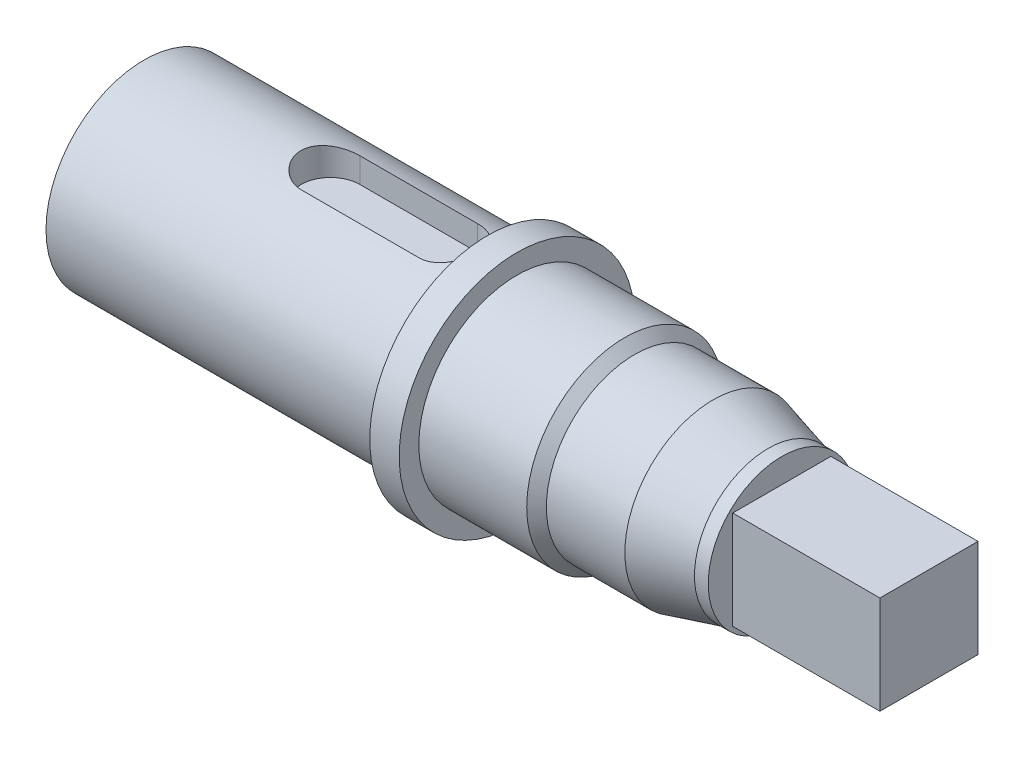
ISO-10303-21;
HEADER;
FILE_DESCRIPTION(('STEP AP214'),'2;1');
FILE_NAME('part.step','',(''),(''),'','','');
FILE_SCHEMA(('AUTOMOTIVE_DESIGN { 1 0 10303 214 1 1 1 1 }'));
ENDSEC;
DATA;
#1=APPLICATION_CONTEXT('core data for automotive mechanical design processes');
#2=APPLICATION_PROTOCOL_DEFINITION('international standard','automotive_design',2000,#1);
#3=PRODUCT_CONTEXT('',#1,'mechanical');
#4=PRODUCT('Part','Part','',(#3));
#5=PRODUCT_RELATED_PRODUCT_CATEGORY('part','',(#4));
#6=PRODUCT_DEFINITION_FORMATION('','',#4);
#7=PRODUCT_DEFINITION_CONTEXT('part definition',#1,'design');
#8=PRODUCT_DEFINITION('design','',#6,#7);
#9=PRODUCT_DEFINITION_SHAPE('','',#8);
#10=(LENGTH_UNIT() NAMED_UNIT(*) SI_UNIT(.MILLI.,.METRE.));
#11=(NAMED_UNIT(*) PLANE_ANGLE_UNIT() SI_UNIT($,.RADIAN.));
#12=(NAMED_UNIT(*) SI_UNIT($,.STERADIAN.) SOLID_ANGLE_UNIT());
#13=UNCERTAINTY_MEASURE_WITH_UNIT(LENGTH_MEASURE(1.E-05),#10,'distance_accuracy_value','');
#14=(GEOMETRIC_REPRESENTATION_CONTEXT(3) GLOBAL_UNCERTAINTY_ASSIGNED_CONTEXT((#13)) GLOBAL_UNIT_ASSIGNED_CONTEXT((#10,
#11,#12)) REPRESENTATION_CONTEXT('',''));
#15=CARTESIAN_POINT('',(0.,0.,0.));
#16=DIRECTION('',(0.,0.,1.));
#17=DIRECTION('',(1.,0.,0.));
#18=AXIS2_PLACEMENT_3D('',#15,#16,#17);
#19=CARTESIAN_POINT('',(0.,0.,0.));
#20=DIRECTION('',(1.,0.,0.));
#21=DIRECTION('',(0.,0.,-1.));
#22=AXIS2_PLACEMENT_3D('',#19,#20,#21);
#23=CYLINDRICAL_SURFACE('',#22,10.);
#24=CARTESIAN_POINT('',(-25.,0.,0.));
#25=DIRECTION('',(1.,0.,0.));
#26=DIRECTION('',(0.,0.,-1.));
#27=AXIS2_PLACEMENT_3D('',#24,#25,#26);
#28=CIRCLE('',#27,10.);
#29=CARTESIAN_POINT('',(-25.,0.,-10.));
#30=VERTEX_POINT('',#29);
#31=EDGE_CURVE('E170',#30,#30,#28,.T.);
#32=ORIENTED_EDGE('',*,*,#31,.T.);
#33=EDGE_LOOP('',(#32));
#34=FACE_BOUND('',#33,.T.);
#35=CARTESIAN_POINT('',(10.,0.,0.));
#36=DIRECTION('',(1.,0.,0.));
#37=DIRECTION('',(0.,0.,-1.));
#38=AXIS2_PLACEMENT_3D('',#35,#36,#37);
#39=CIRCLE('',#38,10.);
#40=CARTESIAN_POINT('',(10.,0.,-10.));
#41=VERTEX_POINT('',#40);
#42=EDGE_CURVE('E173',#41,#41,#39,.T.);
#43=ORIENTED_EDGE('',*,*,#42,.F.);
#44=EDGE_LOOP('',(#43));
#45=FACE_BOUND('',#44,.T.);
#46=DIRECTION('',(1.,0.,0.));
#47=VECTOR('',#46,1.);
#48=CARTESIAN_POINT('',(0.,9.53939201416945,3.));
#49=LINE('',#48,#47);
#50=CARTESIAN_POINT('',(6.,9.53939201416945,3.));
#51=VERTEX_POINT('',#50);
#52=CARTESIAN_POINT('',(-6.,9.53939201416945,3.));
#53=VERTEX_POINT('',#52);
#54=EDGE_CURVE('E51',#51,#53,#49,.F.);
#55=ORIENTED_EDGE('',*,*,#54,.T.);
#56=CARTESIAN_POINT('',(-6.,9.53939201416945,3.));
#57=CARTESIAN_POINT('',(-6.08233552082269,9.53938054248206,3.00001027845728));
#58=CARTESIAN_POINT('',(-6.16466445506322,9.54045772064378,2.99661062684472));
#59=CARTESIAN_POINT('',(-6.32869395276546,9.54470412105986,2.98307142899347));
#60=CARTESIAN_POINT('',(-6.41039465332436,9.54787287296848,2.97293339805418));
#61=CARTESIAN_POINT('',(-6.57238491567318,9.55620668351003,2.94603140625045));
#62=CARTESIAN_POINT('',(-6.65267752404303,9.56136667250114,2.92928426957737));
#63=CARTESIAN_POINT('',(-6.81147584413423,9.57351626651178,2.88932853030395));
#64=CARTESIAN_POINT('',(-6.8899815090674,9.58050591937827,2.86611975872641));
#65=CARTESIAN_POINT('',(-7.12194938799015,9.60391637654136,2.78708584446024));
#66=CARTESIAN_POINT('',(-7.27206843883301,9.6227900783039,2.72181852542972));
#67=CARTESIAN_POINT('',(-7.55922604397904,9.66493213967819,2.56815043531276));
#68=CARTESIAN_POINT('',(-7.69625847076217,9.6882025429064,2.4797388992416));
#69=CARTESIAN_POINT('',(-7.95772298794783,9.73733650515374,2.27929879634442));
#70=CARTESIAN_POINT('',(-8.08168487406091,9.76325505469874,2.16666914746584));
#71=CARTESIAN_POINT('',(-8.30927361483876,9.81429628475077,1.92227736150433));
#72=CARTESIAN_POINT('',(-8.41289703386101,9.8394188301941,1.79051199848164));
#73=CARTESIAN_POINT('',(-8.59892686509456,9.88666477976534,1.50821997465697));
#74=CARTESIAN_POINT('',(-8.68085017978262,9.90871541546877,1.35736167401016));
#75=CARTESIAN_POINT('',(-8.81797700400293,9.94668940088144,1.04324233568303));
#76=CARTESIAN_POINT('',(-8.87318740336795,9.96261433032402,0.879984508687983));
#77=CARTESIAN_POINT('',(-8.953759551791,9.98615279768397,0.550649404820599));
#78=CARTESIAN_POINT('',(-8.97992970351762,9.99399098526792,0.3847862530162));
#79=CARTESIAN_POINT('',(-9.00423469514604,10.0012640407204,0.0508471415689248));
#80=CARTESIAN_POINT('',(-9.00237484267818,10.0007004995012,-0.117228393125342));
#81=CARTESIAN_POINT('',(-8.97121417930856,9.99139205125586,-0.445143199271827));
#82=CARTESIAN_POINT('',(-8.94278930919189,9.98290831016512,-0.60507429076303));
#83=CARTESIAN_POINT('',(-8.86073673037451,9.95903027401822,-0.917780104370316));
#84=CARTESIAN_POINT('',(-8.80710770131732,9.94363561692558,-1.07055445110879));
#85=CARTESIAN_POINT('',(-8.67557555647525,9.90730429851782,-1.36669563173912));
#86=CARTESIAN_POINT('',(-8.5973967112239,9.88630511384914,-1.50993201207613));
#87=CARTESIAN_POINT('',(-8.41920281996559,9.84099249303646,-1.78153105916101));
#88=CARTESIAN_POINT('',(-8.3191828810593,9.81667831471806,-1.90989038323251));
#89=CARTESIAN_POINT('',(-8.09561602381536,9.7662334714278,-2.15330901082206));
#90=CARTESIAN_POINT('',(-7.97131227247379,9.74006890899097,-2.26766702955976));
#91=CARTESIAN_POINT('',(-7.70500515314889,9.68968430229327,-2.47413538985067));
#92=CARTESIAN_POINT('',(-7.56299663927022,9.66546482675133,-2.5662392402618));
#93=CARTESIAN_POINT('',(-7.26343814310014,9.62154457591303,-2.72632814481701));
#94=CARTESIAN_POINT('',(-7.10574564081286,9.60189192491895,-2.79406012682263));
#95=CARTESIAN_POINT('',(-6.78055099203685,9.56991327306402,-2.90171772009404));
#96=CARTESIAN_POINT('',(-6.61306427857131,9.55757606951749,-2.94168586436072));
#97=CARTESIAN_POINT('',(-6.3700102218596,9.54628064650011,-2.97802407180159));
#98=CARTESIAN_POINT('',(-6.29621853164078,9.54370312550533,-2.98626405978017));
#99=CARTESIAN_POINT('',(-6.14829704180096,9.54025857223564,-2.99724711229708));
#100=CARTESIAN_POINT('',(-6.07416790067231,9.53938902493287,-2.99999825936538));
#101=CARTESIAN_POINT('',(-6.,9.53939201416945,-3.));
#102=B_SPLINE_CURVE_WITH_KNOTS('',3,(#56,#57,#58,#59,#60,#61,#62,#63,#64,#65,#66,#67,#68,#69,
#70,#71,#72,#73,#74,#75,#76,#77,#78,#79,#80,#81,#82,#83,#84,#85,#86,#87,#88,#89,#90,#91,#92,#93,
#94,#95,#96,#97,#98,#99,#100,#101),.UNSPECIFIED.,.F.,.F.,(4,2,2,2,2,2,2,2,2,2,2,2,2,2,2,2,2,2,2,
2,2,2,4),(0.,0.246918142439468,0.493780777706085,0.740019009623012,0.986263681482026,
1.47813347402025,1.97023245590779,2.47635119822766,2.98255536239033,3.4992281062007,
4.01576751791672,4.51753600864764,5.01920948804101,5.50490358251093,5.99062312360832,
6.48200583350621,6.9734987373917,7.48389234847122,7.99443465298715,8.51013494368214,
9.02504345105574,9.24774267716777,9.47011372732391),.UNSPECIFIED.);
#103=CARTESIAN_POINT('',(-6.,9.53939201416945,-3.));
#104=VERTEX_POINT('',#103);
#105=EDGE_CURVE('E12',#53,#104,#102,.T.);
#106=ORIENTED_EDGE('',*,*,#105,.T.);
#107=DIRECTION('',(1.,0.,0.));
#108=VECTOR('',#107,1.);
#109=CARTESIAN_POINT('',(0.,9.53939201416945,-3.));
#110=LINE('',#109,#108);
#111=CARTESIAN_POINT('',(6.,9.53939201416945,-3.));
#112=VERTEX_POINT('',#111);
#113=EDGE_CURVE('E197',#104,#112,#110,.T.);
#114=ORIENTED_EDGE('',*,*,#113,.T.);
#115=CARTESIAN_POINT('',(6.,9.53939201416945,-3.));
#116=CARTESIAN_POINT('',(6.08233552082269,9.53938054248206,-3.00001027845728));
#117=CARTESIAN_POINT('',(6.16466445506322,9.54045772064378,-2.99661062684472));
#118=CARTESIAN_POINT('',(6.32869395276546,9.54470412105986,-2.98307142899347));
#119=CARTESIAN_POINT('',(6.41039465332436,9.54787287296848,-2.97293339805418));
#120=CARTESIAN_POINT('',(6.57238491567318,9.55620668351003,-2.94603140625045));
#121=CARTESIAN_POINT('',(6.65267752404303,9.56136667250114,-2.92928426957737));
#122=CARTESIAN_POINT('',(6.81147584413423,9.57351626651178,-2.88932853030395));
#123=CARTESIAN_POINT('',(6.8899815090674,9.58050591937827,-2.86611975872641));
#124=CARTESIAN_POINT('',(7.12194938799015,9.60391637654136,-2.78708584446024));
#125=CARTESIAN_POINT('',(7.27206843883301,9.6227900783039,-2.72181852542972));
#126=CARTESIAN_POINT('',(7.55922604397904,9.66493213967819,-2.56815043531276));
#127=CARTESIAN_POINT('',(7.69625847076217,9.6882025429064,-2.4797388992416));
#128=CARTESIAN_POINT('',(7.95772298794783,9.73733650515374,-2.27929879634442));
#129=CARTESIAN_POINT('',(8.08168487406091,9.76325505469874,-2.16666914746584));
#130=CARTESIAN_POINT('',(8.30927361483876,9.81429628475077,-1.92227736150433));
#131=CARTESIAN_POINT('',(8.41289703386101,9.8394188301941,-1.79051199848164));
#132=CARTESIAN_POINT('',(8.59892686509456,9.88666477976534,-1.50821997465697));
#133=CARTESIAN_POINT('',(8.68085017978262,9.90871541546877,-1.35736167401016));
#134=CARTESIAN_POINT('',(8.81797700400293,9.94668940088144,-1.04324233568303));
#135=CARTESIAN_POINT('',(8.87318740336795,9.96261433032402,-0.879984508687983));
#136=CARTESIAN_POINT('',(8.953759551791,9.98615279768397,-0.550649404820599));
#137=CARTESIAN_POINT('',(8.97992970351762,9.99399098526792,-0.3847862530162));
#138=CARTESIAN_POINT('',(9.00423469514604,10.0012640407204,-0.0508471415689248));
#139=CARTESIAN_POINT('',(9.00237484267818,10.0007004995012,0.117228393125342));
#140=CARTESIAN_POINT('',(8.97121417930856,9.99139205125586,0.445143199271827));
#141=CARTESIAN_POINT('',(8.94278930919189,9.98290831016512,0.60507429076303));
#142=CARTESIAN_POINT('',(8.86073673037451,9.95903027401822,0.917780104370316));
#143=CARTESIAN_POINT('',(8.80710770131732,9.94363561692558,1.07055445110879));
#144=CARTESIAN_POINT('',(8.67557555647525,9.90730429851782,1.36669563173912));
#145=CARTESIAN_POINT('',(8.5973967112239,9.88630511384914,1.50993201207613));
#146=CARTESIAN_POINT('',(8.41920281996559,9.84099249303646,1.78153105916101));
#147=CARTESIAN_POINT('',(8.3191828810593,9.81667831471806,1.90989038323251));
#148=CARTESIAN_POINT('',(8.09561602381536,9.7662334714278,2.15330901082206));
#149=CARTESIAN_POINT('',(7.97131227247379,9.74006890899097,2.26766702955976));
#150=CARTESIAN_POINT('',(7.70500515314889,9.68968430229327,2.47413538985067));
#151=CARTESIAN_POINT('',(7.56299663927022,9.66546482675133,2.5662392402618));
#152=CARTESIAN_POINT('',(7.26343814310014,9.62154457591303,2.72632814481701));
#153=CARTESIAN_POINT('',(7.10574564081286,9.60189192491895,2.79406012682263));
#154=CARTESIAN_POINT('',(6.78055099203685,9.56991327306402,2.90171772009404));
#155=CARTESIAN_POINT('',(6.61306427857131,9.55757606951749,2.94168586436072));
#156=CARTESIAN_POINT('',(6.3700102218596,9.54628064650011,2.97802407180159));
#157=CARTESIAN_POINT('',(6.29621853164078,9.54370312550533,2.98626405978017));
#158=CARTESIAN_POINT('',(6.14829704180096,9.54025857223564,2.99724711229708));
#159=CARTESIAN_POINT('',(6.07416790067231,9.53938902493287,2.99999825936538));
#160=CARTESIAN_POINT('',(6.,9.53939201416945,3.));
#161=B_SPLINE_CURVE_WITH_KNOTS('',3,(#115,#116,#117,#118,#119,#120,#121,#122,#123,#124,#125,
#126,#127,#128,#129,#130,#131,#132,#133,#134,#135,#136,#137,#138,#139,#140,#141,#142,#143,#144,
#145,#146,#147,#148,#149,#150,#151,#152,#153,#154,#155,#156,#157,#158,#159,#160),.UNSPECIFIED.,
.F.,.F.,(4,2,2,2,2,2,2,2,2,2,2,2,2,2,2,2,2,2,2,2,2,2,4),(0.,0.246918142439468,0.493780777706085,
0.740019009623012,0.986263681482026,1.47813347402025,1.97023245590779,2.47635119822766,
2.98255536239033,3.4992281062007,4.01576751791672,4.51753600864764,5.01920948804101,
5.50490358251093,5.99062312360832,6.48200583350621,6.9734987373917,7.48389234847122,
7.99443465298715,8.51013494368214,9.02504345105574,9.24774267716777,9.47011372732391),.UNSPECIFIED.);
#162=EDGE_CURVE('E202',#112,#51,#161,.T.);
#163=ORIENTED_EDGE('',*,*,#162,.T.);
#164=EDGE_LOOP('',(#55,#106,#114,#163));
#165=FACE_BOUND('',#164,.T.);
#166=ADVANCED_FACE('F37',(#34,#45,#165),#23,.T.);
#167=CARTESIAN_POINT('',(0.,0.,0.));
#168=DIRECTION('',(1.,0.,0.));
#169=DIRECTION('',(0.,0.,-1.));
#170=AXIS2_PLACEMENT_3D('',#167,#168,#169);
#171=CYLINDRICAL_SURFACE('',#170,7.50000000000001);
#172=CARTESIAN_POINT('',(38.5980762113533,0.,0.));
#173=DIRECTION('',(1.,0.,0.));
#174=DIRECTION('',(0.,0.,-1.));
#175=AXIS2_PLACEMENT_3D('',#172,#173,#174);
#176=CIRCLE('',#175,7.50000000000001);
#177=CARTESIAN_POINT('',(38.5980762113533,0.,-7.50000000000001));
#178=VERTEX_POINT('',#177);
#179=EDGE_CURVE('E194',#178,#178,#176,.T.);
#180=ORIENTED_EDGE('',*,*,#179,.T.);
#181=EDGE_LOOP('',(#180));
#182=FACE_BOUND('',#181,.T.);
#183=CARTESIAN_POINT('',(40.,0.,0.));
#184=DIRECTION('',(1.,0.,0.));
#185=DIRECTION('',(0.,0.,-1.));
#186=AXIS2_PLACEMENT_3D('',#183,#184,#185);
#187=CIRCLE('',#186,7.50000000000001);
#188=CARTESIAN_POINT('',(40.,0.,-7.50000000000001));
#189=VERTEX_POINT('',#188);
#190=EDGE_CURVE('E164',#189,#189,#187,.F.);
#191=ORIENTED_EDGE('',*,*,#190,.T.);
#192=EDGE_LOOP('',(#191));
#193=FACE_BOUND('',#192,.T.);
#194=ADVANCED_FACE('F251',(#182,#193),#171,.T.);
#195=CARTESIAN_POINT('',(-25.,10.,0.));
#196=DIRECTION('',(-1.,0.,0.));
#197=DIRECTION('',(0.,0.,1.));
#198=AXIS2_PLACEMENT_3D('',#195,#196,#197);
#199=PLANE('',#198);
#200=ORIENTED_EDGE('',*,*,#31,.F.);
#201=EDGE_LOOP('',(#200));
#202=FACE_BOUND('',#201,.T.);
#203=ADVANCED_FACE('F39',(#202),#199,.T.);
#204=CARTESIAN_POINT('',(38.5980762113533,0.,0.));
#205=DIRECTION('',(-1.,0.,0.));
#206=DIRECTION('',(0.,0.,1.));
#207=AXIS2_PLACEMENT_3D('',#204,#205,#206);
#208=CONICAL_SURFACE('',#207,7.50000000000001,0.26179938779915);
#209=CARTESIAN_POINT('',(33.,0.,0.));
#210=DIRECTION('',(1.,0.,0.));
#211=DIRECTION('',(0.,0.,-1.));
#212=AXIS2_PLACEMENT_3D('',#209,#210,#211);
#213=CIRCLE('',#212,9.);
#214=CARTESIAN_POINT('',(33.,0.,-9.));
#215=VERTEX_POINT('',#214);
#216=EDGE_CURVE('E191',#215,#215,#213,.T.);
#217=ORIENTED_EDGE('',*,*,#216,.T.);
#218=EDGE_LOOP('',(#217));
#219=FACE_BOUND('',#218,.T.);
#220=ORIENTED_EDGE('',*,*,#179,.F.);
#221=EDGE_LOOP('',(#220));
#222=FACE_BOUND('',#221,.T.);
#223=ADVANCED_FACE('F392',(#219,#222),#208,.T.);
#224=CARTESIAN_POINT('',(0.,0.,0.));
#225=DIRECTION('',(1.,0.,0.));
#226=DIRECTION('',(0.,0.,-1.));
#227=AXIS2_PLACEMENT_3D('',#224,#225,#226);
#228=CYLINDRICAL_SURFACE('',#227,9.);
#229=CARTESIAN_POINT('',(25.,0.,0.));
#230=DIRECTION('',(1.,0.,0.));
#231=DIRECTION('',(0.,0.,-1.));
#232=AXIS2_PLACEMENT_3D('',#229,#230,#231);
#233=CIRCLE('',#232,9.);
#234=CARTESIAN_POINT('',(25.,0.,-9.));
#235=VERTEX_POINT('',#234);
#236=EDGE_CURVE('E188',#235,#235,#233,.T.);
#237=ORIENTED_EDGE('',*,*,#236,.T.);
#238=EDGE_LOOP('',(#237));
#239=FACE_BOUND('',#238,.T.);
#240=ORIENTED_EDGE('',*,*,#216,.F.);
#241=EDGE_LOOP('',(#240));
#242=FACE_BOUND('',#241,.T.);
#243=ADVANCED_FACE('F382',(#239,#242),#228,.T.);
#244=CARTESIAN_POINT('',(25.,0.,0.));
#245=DIRECTION('',(-1.,0.,0.));
#246=DIRECTION('',(0.,0.,1.));
#247=AXIS2_PLACEMENT_3D('',#244,#245,#246);
#248=CONICAL_SURFACE('',#247,9.,0.78539816339745);
#249=CARTESIAN_POINT('',(24.,0.,0.));
#250=DIRECTION('',(1.,0.,0.));
#251=DIRECTION('',(0.,0.,-1.));
#252=AXIS2_PLACEMENT_3D('',#249,#250,#251);
#253=CIRCLE('',#252,10.);
#254=CARTESIAN_POINT('',(24.,0.,-10.));
#255=VERTEX_POINT('',#254);
#256=EDGE_CURVE('E185',#255,#255,#253,.T.);
#257=ORIENTED_EDGE('',*,*,#256,.T.);
#258=EDGE_LOOP('',(#257));
#259=FACE_BOUND('',#258,.T.);
#260=ORIENTED_EDGE('',*,*,#236,.F.);
#261=EDGE_LOOP('',(#260));
#262=FACE_BOUND('',#261,.T.);
#263=ADVANCED_FACE('F372',(#259,#262),#248,.T.);
#264=CARTESIAN_POINT('',(0.,0.,0.));
#265=DIRECTION('',(1.,0.,0.));
#266=DIRECTION('',(0.,0.,-1.));
#267=AXIS2_PLACEMENT_3D('',#264,#265,#266);
#268=CYLINDRICAL_SURFACE('',#267,10.);
#269=CARTESIAN_POINT('',(13.,0.,0.));
#270=DIRECTION('',(1.,0.,0.));
#271=DIRECTION('',(0.,0.,-1.));
#272=AXIS2_PLACEMENT_3D('',#269,#270,#271);
#273=CIRCLE('',#272,10.);
#274=CARTESIAN_POINT('',(13.,0.,-10.));
#275=VERTEX_POINT('',#274);
#276=EDGE_CURVE('E182',#275,#275,#273,.T.);
#277=ORIENTED_EDGE('',*,*,#276,.T.);
#278=EDGE_LOOP('',(#277));
#279=FACE_BOUND('',#278,.T.);
#280=ORIENTED_EDGE('',*,*,#256,.F.);
#281=EDGE_LOOP('',(#280));
#282=FACE_BOUND('',#281,.T.);
#283=ADVANCED_FACE('F362',(#279,#282),#268,.T.);
#284=CARTESIAN_POINT('',(13.,12.,0.));
#285=DIRECTION('',(1.,0.,0.));
#286=DIRECTION('',(0.,0.,-1.));
#287=AXIS2_PLACEMENT_3D('',#284,#285,#286);
#288=PLANE('',#287);
#289=CARTESIAN_POINT('',(13.,0.,0.));
#290=DIRECTION('',(1.,0.,0.));
#291=DIRECTION('',(0.,0.,-1.));
#292=AXIS2_PLACEMENT_3D('',#289,#290,#291);
#293=CIRCLE('',#292,12.);
#294=CARTESIAN_POINT('',(13.,0.,-12.));
#295=VERTEX_POINT('',#294);
#296=EDGE_CURVE('E179',#295,#295,#293,.T.);
#297=ORIENTED_EDGE('',*,*,#296,.T.);
#298=EDGE_LOOP('',(#297));
#299=FACE_BOUND('',#298,.T.);
#300=ORIENTED_EDGE('',*,*,#276,.F.);
#301=EDGE_LOOP('',(#300));
#302=FACE_BOUND('',#301,.T.);
#303=ADVANCED_FACE('F352',(#299,#302),#288,.T.);
#304=CARTESIAN_POINT('',(0.,0.,0.));
#305=DIRECTION('',(1.,0.,0.));
#306=DIRECTION('',(0.,0.,-1.));
#307=AXIS2_PLACEMENT_3D('',#304,#305,#306);
#308=CYLINDRICAL_SURFACE('',#307,12.);
#309=CARTESIAN_POINT('',(10.,0.,0.));
#310=DIRECTION('',(1.,0.,0.));
#311=DIRECTION('',(0.,0.,-1.));
#312=AXIS2_PLACEMENT_3D('',#309,#310,#311);
#313=CIRCLE('',#312,12.);
#314=CARTESIAN_POINT('',(10.,0.,-12.));
#315=VERTEX_POINT('',#314);
#316=EDGE_CURVE('E176',#315,#315,#313,.T.);
#317=ORIENTED_EDGE('',*,*,#316,.T.);
#318=EDGE_LOOP('',(#317));
#319=FACE_BOUND('',#318,.T.);
#320=ORIENTED_EDGE('',*,*,#296,.F.);
#321=EDGE_LOOP('',(#320));
#322=FACE_BOUND('',#321,.T.);
#323=ADVANCED_FACE('F246',(#319,#322),#308,.T.);
#324=CARTESIAN_POINT('',(10.,10.,0.));
#325=DIRECTION('',(-1.,0.,0.));
#326=DIRECTION('',(0.,0.,1.));
#327=AXIS2_PLACEMENT_3D('',#324,#325,#326);
#328=PLANE('',#327);
#329=ORIENTED_EDGE('',*,*,#42,.T.);
#330=EDGE_LOOP('',(#329));
#331=FACE_BOUND('',#330,.T.);
#332=ORIENTED_EDGE('',*,*,#316,.F.);
#333=EDGE_LOOP('',(#332));
#334=FACE_BOUND('',#333,.T.);
#335=ADVANCED_FACE('F241',(#331,#334),#328,.T.);
#336=CARTESIAN_POINT('',(40.,0.,0.));
#337=DIRECTION('',(1.,0.,0.));
#338=DIRECTION('',(0.,0.,-1.));
#339=AXIS2_PLACEMENT_3D('',#336,#337,#338);
#340=PLANE('',#339);
#341=ORIENTED_EDGE('',*,*,#190,.F.);
#342=EDGE_LOOP('',(#341));
#343=FACE_BOUND('',#342,.T.);
#344=DIRECTION('',(0.,0.,-1.));
#345=VECTOR('',#344,1.);
#346=CARTESIAN_POINT('',(40.,-5.,5.));
#347=LINE('',#346,#345);
#348=CARTESIAN_POINT('',(40.,-5.,5.));
#349=VERTEX_POINT('',#348);
#350=CARTESIAN_POINT('',(40.,-5.,-5.));
#351=VERTEX_POINT('',#350);
#352=EDGE_CURVE('E150',#349,#351,#347,.T.);
#353=ORIENTED_EDGE('',*,*,#352,.F.);
#354=DIRECTION('',(0.,-1.,0.));
#355=VECTOR('',#354,1.);
#356=CARTESIAN_POINT('',(40.,-5.,5.));
#357=LINE('',#356,#355);
#358=CARTESIAN_POINT('',(40.,5.,5.));
#359=VERTEX_POINT('',#358);
#360=EDGE_CURVE('E147',#359,#349,#357,.T.);
#361=ORIENTED_EDGE('',*,*,#360,.F.);
#362=DIRECTION('',(0.,0.,1.));
#363=VECTOR('',#362,1.);
#364=CARTESIAN_POINT('',(40.,5.,5.));
#365=LINE('',#364,#363);
#366=CARTESIAN_POINT('',(40.,5.,-5.));
#367=VERTEX_POINT('',#366);
#368=EDGE_CURVE('E143',#367,#359,#365,.T.);
#369=ORIENTED_EDGE('',*,*,#368,.F.);
#370=DIRECTION('',(0.,1.,0.));
#371=VECTOR('',#370,1.);
#372=CARTESIAN_POINT('',(40.,-5.,-5.));
#373=LINE('',#372,#371);
#374=EDGE_CURVE('E140',#351,#367,#373,.T.);
#375=ORIENTED_EDGE('',*,*,#374,.F.);
#376=EDGE_LOOP('',(#353,#361,#369,#375));
#377=FACE_BOUND('',#376,.T.);
#378=ADVANCED_FACE('F238',(#343,#377),#340,.T.);
#379=CARTESIAN_POINT('',(40.,-5.,-5.));
#380=DIRECTION('',(0.,0.,-1.));
#381=DIRECTION('',(-1.,0.,0.));
#382=AXIS2_PLACEMENT_3D('',#379,#380,#381);
#383=PLANE('',#382);
#384=DIRECTION('',(0.,1.,0.));
#385=VECTOR('',#384,1.);
#386=CARTESIAN_POINT('',(55.,-5.,-5.));
#387=LINE('',#386,#385);
#388=CARTESIAN_POINT('',(55.,-5.,-5.));
#389=VERTEX_POINT('',#388);
#390=CARTESIAN_POINT('',(55.,5.,-5.));
#391=VERTEX_POINT('',#390);
#392=EDGE_CURVE('E117',#389,#391,#387,.T.);
#393=ORIENTED_EDGE('',*,*,#392,.F.);
#394=DIRECTION('',(1.,0.,0.));
#395=VECTOR('',#394,1.);
#396=CARTESIAN_POINT('',(40.,-5.,-5.));
#397=LINE('',#396,#395);
#398=EDGE_CURVE('E162',#351,#389,#397,.T.);
#399=ORIENTED_EDGE('',*,*,#398,.F.);
#400=ORIENTED_EDGE('',*,*,#374,.T.);
#401=DIRECTION('',(1.,0.,0.));
#402=VECTOR('',#401,1.);
#403=CARTESIAN_POINT('',(40.,5.,-5.));
#404=LINE('',#403,#402);
#405=EDGE_CURVE('E153',#367,#391,#404,.T.);
#406=ORIENTED_EDGE('',*,*,#405,.T.);
#407=EDGE_LOOP('',(#393,#399,#400,#406));
#408=FACE_BOUND('',#407,.T.);
#409=ADVANCED_FACE('F229',(#408),#383,.T.);
#410=CARTESIAN_POINT('',(40.,-5.,5.));
#411=DIRECTION('',(0.,-1.,0.));
#412=DIRECTION('',(0.,0.,-1.));
#413=AXIS2_PLACEMENT_3D('',#410,#411,#412);
#414=PLANE('',#413);
#415=DIRECTION('',(0.,0.,-1.));
#416=VECTOR('',#415,1.);
#417=CARTESIAN_POINT('',(55.,-5.,5.));
#418=LINE('',#417,#416);
#419=CARTESIAN_POINT('',(55.,-5.,5.));
#420=VERTEX_POINT('',#419);
#421=EDGE_CURVE('E144',#420,#389,#418,.T.);
#422=ORIENTED_EDGE('',*,*,#421,.F.);
#423=DIRECTION('',(1.,0.,0.));
#424=VECTOR('',#423,1.);
#425=CARTESIAN_POINT('',(40.,-5.,5.));
#426=LINE('',#425,#424);
#427=EDGE_CURVE('E165',#349,#420,#426,.T.);
#428=ORIENTED_EDGE('',*,*,#427,.F.);
#429=ORIENTED_EDGE('',*,*,#352,.T.);
#430=ORIENTED_EDGE('',*,*,#398,.T.);
#431=EDGE_LOOP('',(#422,#428,#429,#430));
#432=FACE_BOUND('',#431,.T.);
#433=ADVANCED_FACE('F225',(#432),#414,.T.);
#434=CARTESIAN_POINT('',(40.,-5.,5.));
#435=DIRECTION('',(0.,0.,1.));
#436=DIRECTION('',(1.,0.,0.));
#437=AXIS2_PLACEMENT_3D('',#434,#435,#436);
#438=PLANE('',#437);
#439=DIRECTION('',(0.,-1.,0.));
#440=VECTOR('',#439,1.);
#441=CARTESIAN_POINT('',(55.,-5.,5.));
#442=LINE('',#441,#440);
#443=CARTESIAN_POINT('',(55.,5.,5.));
#444=VERTEX_POINT('',#443);
#445=EDGE_CURVE('E66',#444,#420,#442,.T.);
#446=ORIENTED_EDGE('',*,*,#445,.F.);
#447=DIRECTION('',(1.,0.,0.));
#448=VECTOR('',#447,1.);
#449=CARTESIAN_POINT('',(40.,5.,5.));
#450=LINE('',#449,#448);
#451=EDGE_CURVE('E167',#359,#444,#450,.T.);
#452=ORIENTED_EDGE('',*,*,#451,.F.);
#453=ORIENTED_EDGE('',*,*,#360,.T.);
#454=ORIENTED_EDGE('',*,*,#427,.T.);
#455=EDGE_LOOP('',(#446,#452,#453,#454));
#456=FACE_BOUND('',#455,.T.);
#457=ADVANCED_FACE('F228',(#456),#438,.T.);
#458=CARTESIAN_POINT('',(40.,5.,5.));
#459=DIRECTION('',(0.,1.,0.));
#460=DIRECTION('',(0.,0.,1.));
#461=AXIS2_PLACEMENT_3D('',#458,#459,#460);
#462=PLANE('',#461);
#463=DIRECTION('',(0.,0.,1.));
#464=VECTOR('',#463,1.);
#465=CARTESIAN_POINT('',(55.,5.,5.));
#466=LINE('',#465,#464);
#467=EDGE_CURVE('E156',#391,#444,#466,.T.);
#468=ORIENTED_EDGE('',*,*,#467,.F.);
#469=ORIENTED_EDGE('',*,*,#405,.F.);
#470=ORIENTED_EDGE('',*,*,#368,.T.);
#471=ORIENTED_EDGE('',*,*,#451,.T.);
#472=EDGE_LOOP('',(#468,#469,#470,#471));
#473=FACE_BOUND('',#472,.T.);
#474=ADVANCED_FACE('F233',(#473),#462,.T.);
#475=CARTESIAN_POINT('',(55.,7.5,0.));
#476=DIRECTION('',(1.,0.,0.));
#477=DIRECTION('',(0.,0.,-1.));
#478=AXIS2_PLACEMENT_3D('',#475,#476,#477);
#479=PLANE('',#478);
#480=ORIENTED_EDGE('',*,*,#421,.T.);
#481=ORIENTED_EDGE('',*,*,#392,.T.);
#482=ORIENTED_EDGE('',*,*,#467,.T.);
#483=ORIENTED_EDGE('',*,*,#445,.T.);
#484=EDGE_LOOP('',(#480,#481,#482,#483));
#485=FACE_BOUND('',#484,.T.);
#486=ADVANCED_FACE('F224',(#485),#479,.T.);
#487=CARTESIAN_POINT('',(-6.,12.,0.));
#488=DIRECTION('',(0.,-1.,0.));
#489=DIRECTION('',(0.,0.,-1.));
#490=AXIS2_PLACEMENT_3D('',#487,#488,#489);
#491=CYLINDRICAL_SURFACE('',#490,3.);
#492=DIRECTION('',(0.,-1.,0.));
#493=VECTOR('',#492,1.);
#494=CARTESIAN_POINT('',(-6.,12.,3.));
#495=LINE('',#494,#493);
#496=CARTESIAN_POINT('',(-6.,7.,3.));
#497=VERTEX_POINT('',#496);
#498=EDGE_CURVE('E109',#53,#497,#495,.T.);
#499=ORIENTED_EDGE('',*,*,#498,.T.);
#500=CARTESIAN_POINT('',(-6.,7.,0.));
#501=DIRECTION('',(0.,1.,0.));
#502=DIRECTION('',(0.,0.,1.));
#503=AXIS2_PLACEMENT_3D('',#500,#501,#502);
#504=CIRCLE('',#503,3.);
#505=CARTESIAN_POINT('',(-6.,7.,-3.));
#506=VERTEX_POINT('',#505);
#507=EDGE_CURVE('E114',#506,#497,#504,.T.);
#508=ORIENTED_EDGE('',*,*,#507,.F.);
#509=DIRECTION('',(0.,-1.,0.));
#510=VECTOR('',#509,1.);
#511=CARTESIAN_POINT('',(-6.,12.,-3.));
#512=LINE('',#511,#510);
#513=EDGE_CURVE('E136',#104,#506,#512,.T.);
#514=ORIENTED_EDGE('',*,*,#513,.F.);
#515=ORIENTED_EDGE('',*,*,#105,.F.);
#516=EDGE_LOOP('',(#499,#508,#514,#515));
#517=FACE_BOUND('',#516,.T.);
#518=ADVANCED_FACE('F111',(#517),#491,.F.);
#519=CARTESIAN_POINT('',(-6.,12.,3.));
#520=DIRECTION('',(0.,0.,-1.));
#521=DIRECTION('',(-1.,0.,0.));
#522=AXIS2_PLACEMENT_3D('',#519,#520,#521);
#523=PLANE('',#522);
#524=DIRECTION('',(0.,-1.,0.));
#525=VECTOR('',#524,1.);
#526=CARTESIAN_POINT('',(6.,12.,3.));
#527=LINE('',#526,#525);
#528=CARTESIAN_POINT('',(6.,7.,3.));
#529=VERTEX_POINT('',#528);
#530=EDGE_CURVE('E118',#51,#529,#527,.T.);
#531=ORIENTED_EDGE('',*,*,#530,.T.);
#532=DIRECTION('',(1.,0.,0.));
#533=VECTOR('',#532,1.);
#534=CARTESIAN_POINT('',(-6.,7.,3.));
#535=LINE('',#534,#533);
#536=EDGE_CURVE('E121',#497,#529,#535,.T.);
#537=ORIENTED_EDGE('',*,*,#536,.F.);
#538=ORIENTED_EDGE('',*,*,#498,.F.);
#539=ORIENTED_EDGE('',*,*,#54,.F.);
#540=EDGE_LOOP('',(#531,#537,#538,#539));
#541=FACE_BOUND('',#540,.T.);
#542=ADVANCED_FACE('F122',(#541),#523,.T.);
#543=CARTESIAN_POINT('',(6.,12.,0.));
#544=DIRECTION('',(0.,-1.,0.));
#545=DIRECTION('',(0.,0.,-1.));
#546=AXIS2_PLACEMENT_3D('',#543,#544,#545);
#547=CYLINDRICAL_SURFACE('',#546,3.);
#548=DIRECTION('',(0.,-1.,0.));
#549=VECTOR('',#548,1.);
#550=CARTESIAN_POINT('',(6.,12.,-3.));
#551=LINE('',#550,#549);
#552=CARTESIAN_POINT('',(6.,7.,-3.));
#553=VERTEX_POINT('',#552);
#554=EDGE_CURVE('E58',#112,#553,#551,.T.);
#555=ORIENTED_EDGE('',*,*,#554,.T.);
#556=CARTESIAN_POINT('',(6.,7.,0.));
#557=DIRECTION('',(0.,1.,0.));
#558=DIRECTION('',(0.,0.,1.));
#559=AXIS2_PLACEMENT_3D('',#556,#557,#558);
#560=CIRCLE('',#559,3.);
#561=EDGE_CURVE('E127',#529,#553,#560,.T.);
#562=ORIENTED_EDGE('',*,*,#561,.F.);
#563=ORIENTED_EDGE('',*,*,#530,.F.);
#564=ORIENTED_EDGE('',*,*,#162,.F.);
#565=EDGE_LOOP('',(#555,#562,#563,#564));
#566=FACE_BOUND('',#565,.T.);
#567=ADVANCED_FACE('F212',(#566),#547,.F.);
#568=CARTESIAN_POINT('',(-6.,12.,-3.));
#569=DIRECTION('',(0.,0.,1.));
#570=DIRECTION('',(1.,0.,0.));
#571=AXIS2_PLACEMENT_3D('',#568,#569,#570);
#572=PLANE('',#571);
#573=ORIENTED_EDGE('',*,*,#513,.T.);
#574=DIRECTION('',(-1.,0.,0.));
#575=VECTOR('',#574,1.);
#576=CARTESIAN_POINT('',(-6.,7.,-3.));
#577=LINE('',#576,#575);
#578=EDGE_CURVE('E131',#553,#506,#577,.T.);
#579=ORIENTED_EDGE('',*,*,#578,.F.);
#580=ORIENTED_EDGE('',*,*,#554,.F.);
#581=ORIENTED_EDGE('',*,*,#113,.F.);
#582=EDGE_LOOP('',(#573,#579,#580,#581));
#583=FACE_BOUND('',#582,.T.);
#584=ADVANCED_FACE('F217',(#583),#572,.T.);
#585=CARTESIAN_POINT('',(-6.,7.,0.));
#586=DIRECTION('',(0.,1.,0.));
#587=DIRECTION('',(0.,0.,1.));
#588=AXIS2_PLACEMENT_3D('',#585,#586,#587);
#589=PLANE('',#588);
#590=ORIENTED_EDGE('',*,*,#507,.T.);
#591=ORIENTED_EDGE('',*,*,#536,.T.);
#592=ORIENTED_EDGE('',*,*,#561,.T.);
#593=ORIENTED_EDGE('',*,*,#578,.T.);
#594=EDGE_LOOP('',(#590,#591,#592,#593));
#595=FACE_BOUND('',#594,.T.);
#596=ADVANCED_FACE('F130',(#595),#589,.T.);
#597=CLOSED_SHELL('',(#166,#194,#203,#223,#243,#263,#283,#303,#323,#335,#378,#409,#433,#457,
#474,#486,#518,#542,#567,#584,#596));
#598=MANIFOLD_SOLID_BREP('B2',#597);
#599=ADVANCED_BREP_SHAPE_REPRESENTATION('',(#18,#598),#14);
#600=SHAPE_DEFINITION_REPRESENTATION(#9,#599);
ENDSEC;
END-ISO-10303-21;
